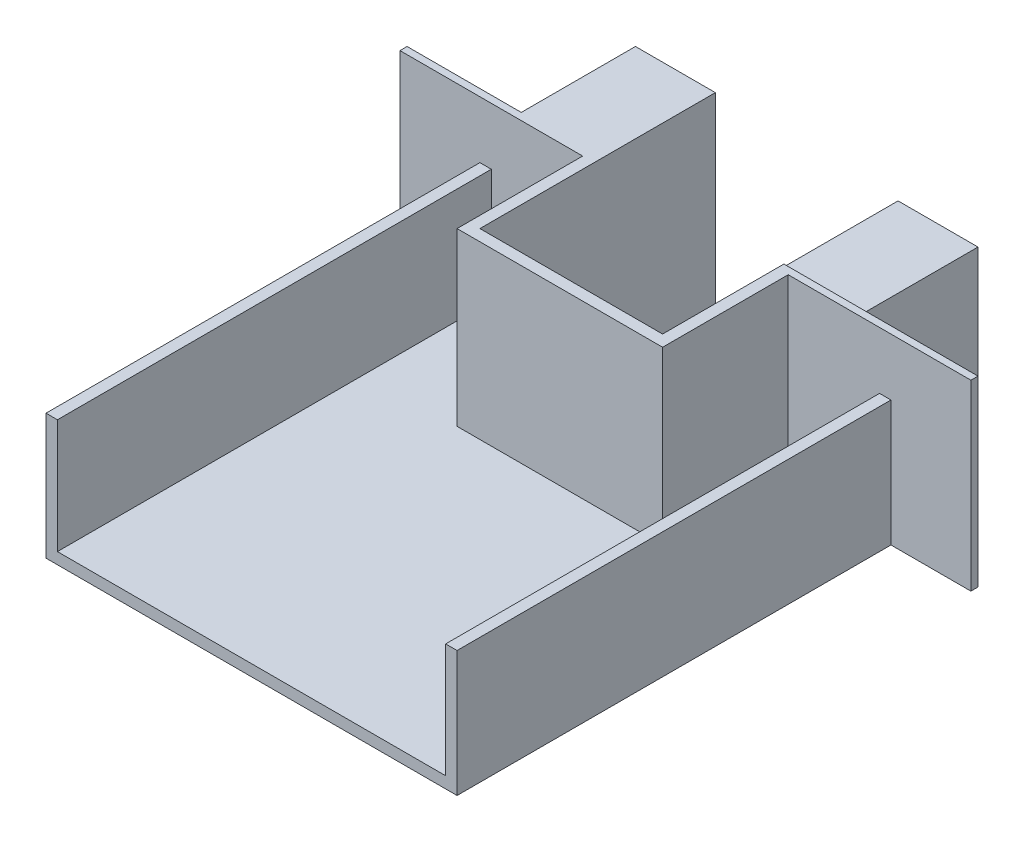
ISO-10303-21;
HEADER;
FILE_DESCRIPTION(('STEP AP214'),'2;1');
FILE_NAME('part.step','',(''),(''),'','','');
FILE_SCHEMA(('AUTOMOTIVE_DESIGN { 1 0 10303 214 1 1 1 1 }'));
ENDSEC;
DATA;
#1=APPLICATION_CONTEXT('core data for automotive mechanical design processes');
#2=APPLICATION_PROTOCOL_DEFINITION('international standard','automotive_design',2000,#1);
#3=PRODUCT_CONTEXT('',#1,'mechanical');
#4=PRODUCT('Part','Part','',(#3));
#5=PRODUCT_RELATED_PRODUCT_CATEGORY('part','',(#4));
#6=PRODUCT_DEFINITION_FORMATION('','',#4);
#7=PRODUCT_DEFINITION_CONTEXT('part definition',#1,'design');
#8=PRODUCT_DEFINITION('design','',#6,#7);
#9=PRODUCT_DEFINITION_SHAPE('','',#8);
#10=(LENGTH_UNIT() NAMED_UNIT(*) SI_UNIT(.MILLI.,.METRE.));
#11=(NAMED_UNIT(*) PLANE_ANGLE_UNIT() SI_UNIT($,.RADIAN.));
#12=(NAMED_UNIT(*) SI_UNIT($,.STERADIAN.) SOLID_ANGLE_UNIT());
#13=UNCERTAINTY_MEASURE_WITH_UNIT(LENGTH_MEASURE(1.E-05),#10,'distance_accuracy_value','');
#14=(GEOMETRIC_REPRESENTATION_CONTEXT(3) GLOBAL_UNCERTAINTY_ASSIGNED_CONTEXT((#13)) GLOBAL_UNIT_ASSIGNED_CONTEXT((#10,
#11,#12)) REPRESENTATION_CONTEXT('',''));
#15=CARTESIAN_POINT('',(0.,0.,0.));
#16=DIRECTION('',(0.,0.,1.));
#17=DIRECTION('',(1.,0.,0.));
#18=AXIS2_PLACEMENT_3D('',#15,#16,#17);
#19=CARTESIAN_POINT('',(-125.,80.,-95.));
#20=DIRECTION('',(0.,0.,-1.));
#21=DIRECTION('',(-1.,0.,0.));
#22=AXIS2_PLACEMENT_3D('',#19,#20,#21);
#23=PLANE('',#22);
#24=DIRECTION('',(0.,-1.,0.));
#25=VECTOR('',#24,1.);
#26=CARTESIAN_POINT('',(-45.,80.,-95.));
#27=LINE('',#26,#25);
#28=CARTESIAN_POINT('',(-45.,80.,-95.));
#29=VERTEX_POINT('',#28);
#30=CARTESIAN_POINT('',(-45.,5.,-95.));
#31=VERTEX_POINT('',#30);
#32=EDGE_CURVE('E204',#29,#31,#27,.T.);
#33=ORIENTED_EDGE('',*,*,#32,.F.);
#34=DIRECTION('',(1.,0.,0.));
#35=VECTOR('',#34,1.);
#36=CARTESIAN_POINT('',(-125.,80.,-95.));
#37=LINE('',#36,#35);
#38=CARTESIAN_POINT('',(-125.,80.,-95.));
#39=VERTEX_POINT('',#38);
#40=EDGE_CURVE('E216',#39,#29,#37,.T.);
#41=ORIENTED_EDGE('',*,*,#40,.F.);
#42=DIRECTION('',(0.,-1.,0.));
#43=VECTOR('',#42,1.);
#44=CARTESIAN_POINT('',(-125.,80.,-95.));
#45=LINE('',#44,#43);
#46=CARTESIAN_POINT('',(-125.,0.,-95.));
#47=VERTEX_POINT('',#46);
#48=EDGE_CURVE('E259',#39,#47,#45,.T.);
#49=ORIENTED_EDGE('',*,*,#48,.T.);
#50=DIRECTION('',(1.,0.,0.));
#51=VECTOR('',#50,1.);
#52=CARTESIAN_POINT('',(-125.,0.,-95.));
#53=LINE('',#52,#51);
#54=CARTESIAN_POINT('',(-90.,0.,-95.));
#55=VERTEX_POINT('',#54);
#56=EDGE_CURVE('E243',#47,#55,#53,.T.);
#57=ORIENTED_EDGE('',*,*,#56,.T.);
#58=DIRECTION('',(0.,-1.,0.));
#59=VECTOR('',#58,1.);
#60=CARTESIAN_POINT('',(-90.,5.,-95.));
#61=LINE('',#60,#59);
#62=CARTESIAN_POINT('',(-90.,55.,-95.));
#63=VERTEX_POINT('',#62);
#64=EDGE_CURVE('E314',#63,#55,#61,.T.);
#65=ORIENTED_EDGE('',*,*,#64,.F.);
#66=DIRECTION('',(-1.,0.,0.));
#67=VECTOR('',#66,1.);
#68=CARTESIAN_POINT('',(-90.,55.,-95.));
#69=LINE('',#68,#67);
#70=CARTESIAN_POINT('',(-85.,55.,-95.));
#71=VERTEX_POINT('',#70);
#72=EDGE_CURVE('E288',#71,#63,#69,.T.);
#73=ORIENTED_EDGE('',*,*,#72,.F.);
#74=DIRECTION('',(0.,-1.,0.));
#75=VECTOR('',#74,1.);
#76=CARTESIAN_POINT('',(-85.,55.,-95.));
#77=LINE('',#76,#75);
#78=CARTESIAN_POINT('',(-85.,5.,-95.));
#79=VERTEX_POINT('',#78);
#80=EDGE_CURVE('E290',#71,#79,#77,.T.);
#81=ORIENTED_EDGE('',*,*,#80,.T.);
#82=DIRECTION('',(-1.,0.,0.));
#83=VECTOR('',#82,1.);
#84=CARTESIAN_POINT('',(-90.,5.,-95.));
#85=LINE('',#84,#83);
#86=EDGE_CURVE('E219',#31,#79,#85,.T.);
#87=ORIENTED_EDGE('',*,*,#86,.F.);
#88=EDGE_LOOP('',(#33,#41,#49,#57,#65,#73,#81,#87));
#89=FACE_BOUND('',#88,.T.);
#90=ADVANCED_FACE('F33',(#89),#23,.F.);
#91=CARTESIAN_POINT('',(0.,5.,0.));
#92=DIRECTION('',(0.,1.,0.));
#93=DIRECTION('',(0.,0.,1.));
#94=AXIS2_PLACEMENT_3D('',#91,#92,#93);
#95=PLANE('',#94);
#96=DIRECTION('',(1.,0.,0.));
#97=VECTOR('',#96,1.);
#98=CARTESIAN_POINT('',(45.,5.,-40.));
#99=LINE('',#98,#97);
#100=CARTESIAN_POINT('',(-45.,5.,-40.));
#101=VERTEX_POINT('',#100);
#102=CARTESIAN_POINT('',(45.,5.,-40.));
#103=VERTEX_POINT('',#102);
#104=EDGE_CURVE('E460',#101,#103,#99,.T.);
#105=ORIENTED_EDGE('',*,*,#104,.F.);
#106=DIRECTION('',(0.,0.,1.));
#107=VECTOR('',#106,1.);
#108=CARTESIAN_POINT('',(-45.,5.,-40.));
#109=LINE('',#108,#107);
#110=EDGE_CURVE('E458',#31,#101,#109,.T.);
#111=ORIENTED_EDGE('',*,*,#110,.F.);
#112=ORIENTED_EDGE('',*,*,#86,.T.);
#113=DIRECTION('',(0.,0.,-1.));
#114=VECTOR('',#113,1.);
#115=CARTESIAN_POINT('',(-85.,5.,-95.));
#116=LINE('',#115,#114);
#117=CARTESIAN_POINT('',(-85.,5.,95.));
#118=VERTEX_POINT('',#117);
#119=EDGE_CURVE('E280',#118,#79,#116,.T.);
#120=ORIENTED_EDGE('',*,*,#119,.F.);
#121=DIRECTION('',(1.,0.,0.));
#122=VECTOR('',#121,1.);
#123=CARTESIAN_POINT('',(-90.,5.,95.));
#124=LINE('',#123,#122);
#125=CARTESIAN_POINT('',(84.9999999999999,5.,95.));
#126=VERTEX_POINT('',#125);
#127=EDGE_CURVE('E301',#118,#126,#124,.T.);
#128=ORIENTED_EDGE('',*,*,#127,.T.);
#129=DIRECTION('',(0.,0.,1.));
#130=VECTOR('',#129,1.);
#131=CARTESIAN_POINT('',(85.,5.,-95.));
#132=LINE('',#131,#130);
#133=CARTESIAN_POINT('',(84.9999999999999,5.,-95.));
#134=VERTEX_POINT('',#133);
#135=EDGE_CURVE('E261',#134,#126,#132,.T.);
#136=ORIENTED_EDGE('',*,*,#135,.F.);
#137=CARTESIAN_POINT('',(45.,5.,-95.));
#138=VERTEX_POINT('',#137);
#139=EDGE_CURVE('E298',#134,#138,#85,.T.);
#140=ORIENTED_EDGE('',*,*,#139,.T.);
#141=DIRECTION('',(0.,0.,-1.));
#142=VECTOR('',#141,1.);
#143=CARTESIAN_POINT('',(45.,5.,-95.));
#144=LINE('',#143,#142);
#145=EDGE_CURVE('E211',#103,#138,#144,.T.);
#146=ORIENTED_EDGE('',*,*,#145,.F.);
#147=EDGE_LOOP('',(#105,#111,#112,#120,#128,#136,#140,#146));
#148=FACE_BOUND('',#147,.T.);
#149=ADVANCED_FACE('F356',(#148),#95,.T.);
#150=DIRECTION('',(0.,-1.,0.));
#151=VECTOR('',#150,1.);
#152=CARTESIAN_POINT('',(45.,80.,-95.));
#153=LINE('',#152,#151);
#154=CARTESIAN_POINT('',(45.,80.,-95.));
#155=VERTEX_POINT('',#154);
#156=EDGE_CURVE('E348',#155,#138,#153,.T.);
#157=ORIENTED_EDGE('',*,*,#156,.T.);
#158=ORIENTED_EDGE('',*,*,#139,.F.);
#159=DIRECTION('',(0.,-1.,0.));
#160=VECTOR('',#159,1.);
#161=CARTESIAN_POINT('',(85.,55.,-95.));
#162=LINE('',#161,#160);
#163=CARTESIAN_POINT('',(85.,55.,-95.));
#164=VERTEX_POINT('',#163);
#165=EDGE_CURVE('E277',#164,#134,#162,.T.);
#166=ORIENTED_EDGE('',*,*,#165,.F.);
#167=DIRECTION('',(-1.,0.,0.));
#168=VECTOR('',#167,1.);
#169=CARTESIAN_POINT('',(90.,55.,-95.));
#170=LINE('',#169,#168);
#171=CARTESIAN_POINT('',(90.,55.,-95.));
#172=VERTEX_POINT('',#171);
#173=EDGE_CURVE('E265',#172,#164,#170,.T.);
#174=ORIENTED_EDGE('',*,*,#173,.F.);
#175=DIRECTION('',(0.,-1.,0.));
#176=VECTOR('',#175,1.);
#177=CARTESIAN_POINT('',(90.,5.,-95.));
#178=LINE('',#177,#176);
#179=CARTESIAN_POINT('',(90.,0.,-95.));
#180=VERTEX_POINT('',#179);
#181=EDGE_CURVE('E41',#172,#180,#178,.T.);
#182=ORIENTED_EDGE('',*,*,#181,.T.);
#183=CARTESIAN_POINT('',(125.,0.,-95.));
#184=VERTEX_POINT('',#183);
#185=EDGE_CURVE('E241',#180,#184,#53,.T.);
#186=ORIENTED_EDGE('',*,*,#185,.T.);
#187=DIRECTION('',(0.,-1.,0.));
#188=VECTOR('',#187,1.);
#189=CARTESIAN_POINT('',(125.,80.,-95.));
#190=LINE('',#189,#188);
#191=CARTESIAN_POINT('',(125.,80.,-95.));
#192=VERTEX_POINT('',#191);
#193=EDGE_CURVE('E256',#192,#184,#190,.T.);
#194=ORIENTED_EDGE('',*,*,#193,.F.);
#195=EDGE_CURVE('E228',#155,#192,#37,.T.);
#196=ORIENTED_EDGE('',*,*,#195,.F.);
#197=EDGE_LOOP('',(#157,#158,#166,#174,#182,#186,#194,#196));
#198=FACE_BOUND('',#197,.T.);
#199=ADVANCED_FACE('F320',(#198),#23,.F.);
#200=CARTESIAN_POINT('',(-125.,80.,-98.1090481998462));
#201=DIRECTION('',(0.,0.,1.));
#202=DIRECTION('',(1.,0.,0.));
#203=AXIS2_PLACEMENT_3D('',#200,#201,#202);
#204=PLANE('',#203);
#205=DIRECTION('',(1.,0.,0.));
#206=VECTOR('',#205,1.);
#207=CARTESIAN_POINT('',(75.,78.9484102153776,-98.1090481998462));
#208=LINE('',#207,#206);
#209=CARTESIAN_POINT('',(40.,78.9484102153776,-98.1090481998462));
#210=VERTEX_POINT('',#209);
#211=CARTESIAN_POINT('',(75.,78.9484102153776,-98.1090481998462));
#212=VERTEX_POINT('',#211);
#213=EDGE_CURVE('E406',#210,#212,#208,.T.);
#214=ORIENTED_EDGE('',*,*,#213,.F.);
#215=DIRECTION('',(0.,1.,0.));
#216=VECTOR('',#215,1.);
#217=CARTESIAN_POINT('',(40.,-43.,-98.1090481998462));
#218=LINE('',#217,#216);
#219=CARTESIAN_POINT('',(40.,80.,-98.1090481998462));
#220=VERTEX_POINT('',#219);
#221=EDGE_CURVE('E339',#210,#220,#218,.T.);
#222=ORIENTED_EDGE('',*,*,#221,.T.);
#223=DIRECTION('',(-1.,0.,0.));
#224=VECTOR('',#223,1.);
#225=CARTESIAN_POINT('',(-125.,80.,-98.1090481998462));
#226=LINE('',#225,#224);
#227=CARTESIAN_POINT('',(125.,80.,-98.1090481998462));
#228=VERTEX_POINT('',#227);
#229=EDGE_CURVE('E235',#228,#220,#226,.T.);
#230=ORIENTED_EDGE('',*,*,#229,.F.);
#231=DIRECTION('',(0.,-1.,0.));
#232=VECTOR('',#231,1.);
#233=CARTESIAN_POINT('',(125.,80.,-98.1090481998462));
#234=LINE('',#233,#232);
#235=CARTESIAN_POINT('',(125.,0.,-98.1090481998462));
#236=VERTEX_POINT('',#235);
#237=EDGE_CURVE('E253',#228,#236,#234,.T.);
#238=ORIENTED_EDGE('',*,*,#237,.T.);
#239=DIRECTION('',(-1.,0.,0.));
#240=VECTOR('',#239,1.);
#241=CARTESIAN_POINT('',(-125.,0.,-98.1090481998462));
#242=LINE('',#241,#240);
#243=CARTESIAN_POINT('',(75.,0.,-98.1090481998462));
#244=VERTEX_POINT('',#243);
#245=EDGE_CURVE('E249',#236,#244,#242,.T.);
#246=ORIENTED_EDGE('',*,*,#245,.T.);
#247=DIRECTION('',(0.,-1.,0.));
#248=VECTOR('',#247,1.);
#249=CARTESIAN_POINT('',(75.,78.9484102153776,-98.1090481998462));
#250=LINE('',#249,#248);
#251=EDGE_CURVE('E56',#212,#244,#250,.T.);
#252=ORIENTED_EDGE('',*,*,#251,.F.);
#253=EDGE_LOOP('',(#214,#222,#230,#238,#246,#252));
#254=FACE_BOUND('',#253,.T.);
#255=ADVANCED_FACE('F337',(#254),#204,.F.);
#256=DIRECTION('',(0.,1.,0.));
#257=VECTOR('',#256,1.);
#258=CARTESIAN_POINT('',(-75.,80.,-98.1090481998462));
#259=LINE('',#258,#257);
#260=CARTESIAN_POINT('',(-75.,0.,-98.1090481998462));
#261=VERTEX_POINT('',#260);
#262=CARTESIAN_POINT('',(-75.,80.,-98.1090481998462));
#263=VERTEX_POINT('',#262);
#264=EDGE_CURVE('E384',#261,#263,#259,.T.);
#265=ORIENTED_EDGE('',*,*,#264,.F.);
#266=CARTESIAN_POINT('',(-125.,0.,-98.1090481998462));
#267=VERTEX_POINT('',#266);
#268=EDGE_CURVE('E248',#261,#267,#242,.T.);
#269=ORIENTED_EDGE('',*,*,#268,.T.);
#270=DIRECTION('',(0.,-1.,0.));
#271=VECTOR('',#270,1.);
#272=CARTESIAN_POINT('',(-125.,80.,-98.1090481998462));
#273=LINE('',#272,#271);
#274=CARTESIAN_POINT('',(-125.,80.,-98.1090481998462));
#275=VERTEX_POINT('',#274);
#276=EDGE_CURVE('E237',#275,#267,#273,.T.);
#277=ORIENTED_EDGE('',*,*,#276,.F.);
#278=EDGE_CURVE('E230',#263,#275,#226,.T.);
#279=ORIENTED_EDGE('',*,*,#278,.F.);
#280=EDGE_LOOP('',(#265,#269,#277,#279));
#281=FACE_BOUND('',#280,.T.);
#282=ADVANCED_FACE('F382',(#281),#204,.F.);
#283=CARTESIAN_POINT('',(90.,5.,-95.));
#284=DIRECTION('',(-1.,0.,0.));
#285=DIRECTION('',(0.,0.,1.));
#286=AXIS2_PLACEMENT_3D('',#283,#284,#285);
#287=PLANE('',#286);
#288=DIRECTION('',(0.,0.,-1.));
#289=VECTOR('',#288,1.);
#290=CARTESIAN_POINT('',(90.,0.,-95.));
#291=LINE('',#290,#289);
#292=CARTESIAN_POINT('',(90.,0.,95.));
#293=VERTEX_POINT('',#292);
#294=EDGE_CURVE('E297',#293,#180,#291,.T.);
#295=ORIENTED_EDGE('',*,*,#294,.T.);
#296=ORIENTED_EDGE('',*,*,#181,.F.);
#297=DIRECTION('',(0.,0.,-1.));
#298=VECTOR('',#297,1.);
#299=CARTESIAN_POINT('',(90.,55.,-95.));
#300=LINE('',#299,#298);
#301=CARTESIAN_POINT('',(90.,55.,95.));
#302=VERTEX_POINT('',#301);
#303=EDGE_CURVE('E262',#302,#172,#300,.T.);
#304=ORIENTED_EDGE('',*,*,#303,.F.);
#305=DIRECTION('',(0.,-1.,0.));
#306=VECTOR('',#305,1.);
#307=CARTESIAN_POINT('',(90.,5.,95.));
#308=LINE('',#307,#306);
#309=EDGE_CURVE('E303',#302,#293,#308,.T.);
#310=ORIENTED_EDGE('',*,*,#309,.T.);
#311=EDGE_LOOP('',(#295,#296,#304,#310));
#312=FACE_BOUND('',#311,.T.);
#313=ADVANCED_FACE('F35',(#312),#287,.F.);
#314=CARTESIAN_POINT('',(-90.,5.,-95.));
#315=DIRECTION('',(1.,0.,0.));
#316=DIRECTION('',(0.,0.,-1.));
#317=AXIS2_PLACEMENT_3D('',#314,#315,#316);
#318=PLANE('',#317);
#319=DIRECTION('',(0.,0.,1.));
#320=VECTOR('',#319,1.);
#321=CARTESIAN_POINT('',(-90.,0.,-95.));
#322=LINE('',#321,#320);
#323=CARTESIAN_POINT('',(-90.,0.,95.));
#324=VERTEX_POINT('',#323);
#325=EDGE_CURVE('E305',#55,#324,#322,.T.);
#326=ORIENTED_EDGE('',*,*,#325,.T.);
#327=DIRECTION('',(0.,-1.,0.));
#328=VECTOR('',#327,1.);
#329=CARTESIAN_POINT('',(-90.,5.,95.));
#330=LINE('',#329,#328);
#331=CARTESIAN_POINT('',(-90.,55.,95.));
#332=VERTEX_POINT('',#331);
#333=EDGE_CURVE('E311',#332,#324,#330,.T.);
#334=ORIENTED_EDGE('',*,*,#333,.F.);
#335=DIRECTION('',(0.,0.,1.));
#336=VECTOR('',#335,1.);
#337=CARTESIAN_POINT('',(-90.,55.,-95.));
#338=LINE('',#337,#336);
#339=EDGE_CURVE('E281',#63,#332,#338,.T.);
#340=ORIENTED_EDGE('',*,*,#339,.F.);
#341=ORIENTED_EDGE('',*,*,#64,.T.);
#342=EDGE_LOOP('',(#326,#334,#340,#341));
#343=FACE_BOUND('',#342,.T.);
#344=ADVANCED_FACE('F476',(#343),#318,.F.);
#345=CARTESIAN_POINT('',(-90.,5.,95.));
#346=DIRECTION('',(0.,0.,-1.));
#347=DIRECTION('',(-1.,0.,0.));
#348=AXIS2_PLACEMENT_3D('',#345,#346,#347);
#349=PLANE('',#348);
#350=DIRECTION('',(1.,0.,0.));
#351=VECTOR('',#350,1.);
#352=CARTESIAN_POINT('',(-90.,0.,95.));
#353=LINE('',#352,#351);
#354=EDGE_CURVE('E307',#324,#293,#353,.T.);
#355=ORIENTED_EDGE('',*,*,#354,.T.);
#356=ORIENTED_EDGE('',*,*,#309,.F.);
#357=DIRECTION('',(1.,0.,0.));
#358=VECTOR('',#357,1.);
#359=CARTESIAN_POINT('',(90.,55.,95.));
#360=LINE('',#359,#358);
#361=CARTESIAN_POINT('',(85.,55.,95.));
#362=VERTEX_POINT('',#361);
#363=EDGE_CURVE('E269',#362,#302,#360,.T.);
#364=ORIENTED_EDGE('',*,*,#363,.F.);
#365=DIRECTION('',(0.,-1.,0.));
#366=VECTOR('',#365,1.);
#367=CARTESIAN_POINT('',(85.,55.,95.));
#368=LINE('',#367,#366);
#369=EDGE_CURVE('E272',#362,#126,#368,.T.);
#370=ORIENTED_EDGE('',*,*,#369,.T.);
#371=ORIENTED_EDGE('',*,*,#127,.F.);
#372=DIRECTION('',(0.,-1.,0.));
#373=VECTOR('',#372,1.);
#374=CARTESIAN_POINT('',(-85.,55.,95.));
#375=LINE('',#374,#373);
#376=CARTESIAN_POINT('',(-85.,55.,95.));
#377=VERTEX_POINT('',#376);
#378=EDGE_CURVE('E294',#377,#118,#375,.T.);
#379=ORIENTED_EDGE('',*,*,#378,.F.);
#380=DIRECTION('',(1.,0.,0.));
#381=VECTOR('',#380,1.);
#382=CARTESIAN_POINT('',(-90.,55.,95.));
#383=LINE('',#382,#381);
#384=EDGE_CURVE('E284',#332,#377,#383,.T.);
#385=ORIENTED_EDGE('',*,*,#384,.F.);
#386=ORIENTED_EDGE('',*,*,#333,.T.);
#387=EDGE_LOOP('',(#355,#356,#364,#370,#371,#379,#385,#386));
#388=FACE_BOUND('',#387,.T.);
#389=ADVANCED_FACE('F366',(#388),#349,.F.);
#390=CARTESIAN_POINT('',(0.,0.,0.));
#391=DIRECTION('',(0.,1.,0.));
#392=DIRECTION('',(0.,0.,1.));
#393=AXIS2_PLACEMENT_3D('',#390,#391,#392);
#394=PLANE('',#393);
#395=DIRECTION('',(0.,0.,1.));
#396=VECTOR('',#395,1.);
#397=CARTESIAN_POINT('',(-40.,0.,-148.109048199846));
#398=LINE('',#397,#396);
#399=CARTESIAN_POINT('',(-40.,0.,-148.109048199846));
#400=VERTEX_POINT('',#399);
#401=CARTESIAN_POINT('',(-40.,0.,-45.));
#402=VERTEX_POINT('',#401);
#403=EDGE_CURVE('E400',#400,#402,#398,.T.);
#404=ORIENTED_EDGE('',*,*,#403,.T.);
#405=DIRECTION('',(1.,0.,0.));
#406=VECTOR('',#405,1.);
#407=CARTESIAN_POINT('',(0.,0.,-45.));
#408=LINE('',#407,#406);
#409=CARTESIAN_POINT('',(40.,0.,-45.));
#410=VERTEX_POINT('',#409);
#411=EDGE_CURVE('E11',#402,#410,#408,.T.);
#412=ORIENTED_EDGE('',*,*,#411,.T.);
#413=DIRECTION('',(0.,0.,1.));
#414=VECTOR('',#413,1.);
#415=CARTESIAN_POINT('',(40.,0.,-148.109048199846));
#416=LINE('',#415,#414);
#417=CARTESIAN_POINT('',(40.,0.,-148.109048199846));
#418=VERTEX_POINT('',#417);
#419=EDGE_CURVE('E420',#418,#410,#416,.T.);
#420=ORIENTED_EDGE('',*,*,#419,.F.);
#421=DIRECTION('',(-1.,0.,0.));
#422=VECTOR('',#421,1.);
#423=CARTESIAN_POINT('',(75.,0.,-148.109048199846));
#424=LINE('',#423,#422);
#425=CARTESIAN_POINT('',(75.,0.,-148.109048199846));
#426=VERTEX_POINT('',#425);
#427=EDGE_CURVE('E405',#426,#418,#424,.T.);
#428=ORIENTED_EDGE('',*,*,#427,.F.);
#429=DIRECTION('',(0.,0.,1.));
#430=VECTOR('',#429,1.);
#431=CARTESIAN_POINT('',(75.,0.,-148.109048199846));
#432=LINE('',#431,#430);
#433=EDGE_CURVE('E242',#426,#244,#432,.T.);
#434=ORIENTED_EDGE('',*,*,#433,.T.);
#435=ORIENTED_EDGE('',*,*,#245,.F.);
#436=DIRECTION('',(0.,0.,-1.));
#437=VECTOR('',#436,1.);
#438=CARTESIAN_POINT('',(125.,0.,-95.));
#439=LINE('',#438,#437);
#440=EDGE_CURVE('E246',#184,#236,#439,.T.);
#441=ORIENTED_EDGE('',*,*,#440,.F.);
#442=ORIENTED_EDGE('',*,*,#185,.F.);
#443=ORIENTED_EDGE('',*,*,#294,.F.);
#444=ORIENTED_EDGE('',*,*,#354,.F.);
#445=ORIENTED_EDGE('',*,*,#325,.F.);
#446=ORIENTED_EDGE('',*,*,#56,.F.);
#447=DIRECTION('',(0.,0.,1.));
#448=VECTOR('',#447,1.);
#449=CARTESIAN_POINT('',(-125.,0.,-95.));
#450=LINE('',#449,#448);
#451=EDGE_CURVE('E238',#267,#47,#450,.T.);
#452=ORIENTED_EDGE('',*,*,#451,.F.);
#453=ORIENTED_EDGE('',*,*,#268,.F.);
#454=DIRECTION('',(0.,0.,1.));
#455=VECTOR('',#454,1.);
#456=CARTESIAN_POINT('',(-75.,0.,-148.109048199846));
#457=LINE('',#456,#455);
#458=CARTESIAN_POINT('',(-75.,0.,-148.109048199846));
#459=VERTEX_POINT('',#458);
#460=EDGE_CURVE('E378',#459,#261,#457,.T.);
#461=ORIENTED_EDGE('',*,*,#460,.F.);
#462=DIRECTION('',(-1.,0.,0.));
#463=VECTOR('',#462,1.);
#464=CARTESIAN_POINT('',(-40.,0.,-148.109048199846));
#465=LINE('',#464,#463);
#466=EDGE_CURVE('E389',#400,#459,#465,.T.);
#467=ORIENTED_EDGE('',*,*,#466,.F.);
#468=EDGE_LOOP('',(#404,#412,#420,#428,#434,#435,#441,#442,#443,#444,#445,#446,#452,#453,#461,#467));
#469=FACE_BOUND('',#468,.T.);
#470=ADVANCED_FACE('F328',(#469),#394,.F.);
#471=CARTESIAN_POINT('',(-85.,55.,-95.));
#472=DIRECTION('',(-1.,0.,0.));
#473=DIRECTION('',(0.,0.,1.));
#474=AXIS2_PLACEMENT_3D('',#471,#472,#473);
#475=PLANE('',#474);
#476=ORIENTED_EDGE('',*,*,#119,.T.);
#477=ORIENTED_EDGE('',*,*,#80,.F.);
#478=DIRECTION('',(0.,0.,-1.));
#479=VECTOR('',#478,1.);
#480=CARTESIAN_POINT('',(-85.,55.,-95.));
#481=LINE('',#480,#479);
#482=EDGE_CURVE('E286',#377,#71,#481,.T.);
#483=ORIENTED_EDGE('',*,*,#482,.F.);
#484=ORIENTED_EDGE('',*,*,#378,.T.);
#485=EDGE_LOOP('',(#476,#477,#483,#484));
#486=FACE_BOUND('',#485,.T.);
#487=ADVANCED_FACE('F470',(#486),#475,.F.);
#488=CARTESIAN_POINT('',(0.,55.,0.));
#489=DIRECTION('',(0.,1.,0.));
#490=DIRECTION('',(0.,0.,1.));
#491=AXIS2_PLACEMENT_3D('',#488,#489,#490);
#492=PLANE('',#491);
#493=ORIENTED_EDGE('',*,*,#339,.T.);
#494=ORIENTED_EDGE('',*,*,#384,.T.);
#495=ORIENTED_EDGE('',*,*,#482,.T.);
#496=ORIENTED_EDGE('',*,*,#72,.T.);
#497=EDGE_LOOP('',(#493,#494,#495,#496));
#498=FACE_BOUND('',#497,.T.);
#499=ADVANCED_FACE('F475',(#498),#492,.T.);
#500=CARTESIAN_POINT('',(85.,55.,-95.));
#501=DIRECTION('',(1.,0.,0.));
#502=DIRECTION('',(0.,0.,-1.));
#503=AXIS2_PLACEMENT_3D('',#500,#501,#502);
#504=PLANE('',#503);
#505=ORIENTED_EDGE('',*,*,#135,.T.);
#506=ORIENTED_EDGE('',*,*,#369,.F.);
#507=DIRECTION('',(0.,0.,1.));
#508=VECTOR('',#507,1.);
#509=CARTESIAN_POINT('',(85.,55.,-95.));
#510=LINE('',#509,#508);
#511=EDGE_CURVE('E267',#164,#362,#510,.T.);
#512=ORIENTED_EDGE('',*,*,#511,.F.);
#513=ORIENTED_EDGE('',*,*,#165,.T.);
#514=EDGE_LOOP('',(#505,#506,#512,#513));
#515=FACE_BOUND('',#514,.T.);
#516=ADVANCED_FACE('F361',(#515),#504,.F.);
#517=CARTESIAN_POINT('',(0.,55.,0.));
#518=DIRECTION('',(0.,-1.,0.));
#519=DIRECTION('',(0.,0.,-1.));
#520=AXIS2_PLACEMENT_3D('',#517,#518,#519);
#521=PLANE('',#520);
#522=ORIENTED_EDGE('',*,*,#303,.T.);
#523=ORIENTED_EDGE('',*,*,#173,.T.);
#524=ORIENTED_EDGE('',*,*,#511,.T.);
#525=ORIENTED_EDGE('',*,*,#363,.T.);
#526=EDGE_LOOP('',(#522,#523,#524,#525));
#527=FACE_BOUND('',#526,.T.);
#528=ADVANCED_FACE('F364',(#527),#521,.F.);
#529=CARTESIAN_POINT('',(-125.,80.,-95.));
#530=DIRECTION('',(1.,0.,0.));
#531=DIRECTION('',(0.,0.,-1.));
#532=AXIS2_PLACEMENT_3D('',#529,#530,#531);
#533=PLANE('',#532);
#534=ORIENTED_EDGE('',*,*,#451,.T.);
#535=ORIENTED_EDGE('',*,*,#48,.F.);
#536=DIRECTION('',(0.,0.,1.));
#537=VECTOR('',#536,1.);
#538=CARTESIAN_POINT('',(-125.,80.,-95.));
#539=LINE('',#538,#537);
#540=EDGE_CURVE('E225',#275,#39,#539,.T.);
#541=ORIENTED_EDGE('',*,*,#540,.F.);
#542=ORIENTED_EDGE('',*,*,#276,.T.);
#543=EDGE_LOOP('',(#534,#535,#541,#542));
#544=FACE_BOUND('',#543,.T.);
#545=ADVANCED_FACE('F374',(#544),#533,.F.);
#546=CARTESIAN_POINT('',(125.,80.,-95.));
#547=DIRECTION('',(-1.,0.,0.));
#548=DIRECTION('',(0.,0.,1.));
#549=AXIS2_PLACEMENT_3D('',#546,#547,#548);
#550=PLANE('',#549);
#551=ORIENTED_EDGE('',*,*,#440,.T.);
#552=ORIENTED_EDGE('',*,*,#237,.F.);
#553=DIRECTION('',(0.,0.,-1.));
#554=VECTOR('',#553,1.);
#555=CARTESIAN_POINT('',(125.,80.,-95.));
#556=LINE('',#555,#554);
#557=EDGE_CURVE('E227',#192,#228,#556,.T.);
#558=ORIENTED_EDGE('',*,*,#557,.F.);
#559=ORIENTED_EDGE('',*,*,#193,.T.);
#560=EDGE_LOOP('',(#551,#552,#558,#559));
#561=FACE_BOUND('',#560,.T.);
#562=ADVANCED_FACE('F334',(#561),#550,.F.);
#563=CARTESIAN_POINT('',(0.,80.,0.));
#564=DIRECTION('',(0.,-1.,0.));
#565=DIRECTION('',(0.,0.,-1.));
#566=AXIS2_PLACEMENT_3D('',#563,#564,#565);
#567=PLANE('',#566);
#568=ORIENTED_EDGE('',*,*,#229,.T.);
#569=DIRECTION('',(0.,0.,-1.));
#570=VECTOR('',#569,1.);
#571=CARTESIAN_POINT('',(40.,80.,-98.1090481998462));
#572=LINE('',#571,#570);
#573=CARTESIAN_POINT('',(40.,80.,-45.));
#574=VERTEX_POINT('',#573);
#575=EDGE_CURVE('E341',#574,#220,#572,.T.);
#576=ORIENTED_EDGE('',*,*,#575,.F.);
#577=DIRECTION('',(-1.,0.,0.));
#578=VECTOR('',#577,1.);
#579=CARTESIAN_POINT('',(-40.,80.,-45.));
#580=LINE('',#579,#578);
#581=CARTESIAN_POINT('',(-40.,80.,-45.));
#582=VERTEX_POINT('',#581);
#583=EDGE_CURVE('E351',#574,#582,#580,.T.);
#584=ORIENTED_EDGE('',*,*,#583,.T.);
#585=DIRECTION('',(0.,0.,1.));
#586=VECTOR('',#585,1.);
#587=CARTESIAN_POINT('',(-40.,80.,-148.109048199846));
#588=LINE('',#587,#586);
#589=CARTESIAN_POINT('',(-40.,80.,-148.109048199846));
#590=VERTEX_POINT('',#589);
#591=EDGE_CURVE('E396',#590,#582,#588,.T.);
#592=ORIENTED_EDGE('',*,*,#591,.F.);
#593=DIRECTION('',(1.,0.,0.));
#594=VECTOR('',#593,1.);
#595=CARTESIAN_POINT('',(-40.,80.,-148.109048199846));
#596=LINE('',#595,#594);
#597=CARTESIAN_POINT('',(-75.,80.,-148.109048199846));
#598=VERTEX_POINT('',#597);
#599=EDGE_CURVE('E394',#598,#590,#596,.T.);
#600=ORIENTED_EDGE('',*,*,#599,.F.);
#601=DIRECTION('',(0.,0.,1.));
#602=VECTOR('',#601,1.);
#603=CARTESIAN_POINT('',(-75.,80.,-148.109048199846));
#604=LINE('',#603,#602);
#605=EDGE_CURVE('E48',#598,#263,#604,.T.);
#606=ORIENTED_EDGE('',*,*,#605,.T.);
#607=ORIENTED_EDGE('',*,*,#278,.T.);
#608=ORIENTED_EDGE('',*,*,#540,.T.);
#609=ORIENTED_EDGE('',*,*,#40,.T.);
#610=DIRECTION('',(0.,0.,1.));
#611=VECTOR('',#610,1.);
#612=CARTESIAN_POINT('',(-45.,80.,-40.));
#613=LINE('',#612,#611);
#614=CARTESIAN_POINT('',(-45.,80.,-40.));
#615=VERTEX_POINT('',#614);
#616=EDGE_CURVE('E201',#29,#615,#613,.T.);
#617=ORIENTED_EDGE('',*,*,#616,.T.);
#618=DIRECTION('',(1.,0.,0.));
#619=VECTOR('',#618,1.);
#620=CARTESIAN_POINT('',(45.,80.,-40.));
#621=LINE('',#620,#619);
#622=CARTESIAN_POINT('',(45.,80.,-40.));
#623=VERTEX_POINT('',#622);
#624=EDGE_CURVE('E210',#615,#623,#621,.T.);
#625=ORIENTED_EDGE('',*,*,#624,.T.);
#626=DIRECTION('',(0.,0.,-1.));
#627=VECTOR('',#626,1.);
#628=CARTESIAN_POINT('',(45.,80.,-95.));
#629=LINE('',#628,#627);
#630=EDGE_CURVE('E345',#623,#155,#629,.T.);
#631=ORIENTED_EDGE('',*,*,#630,.T.);
#632=ORIENTED_EDGE('',*,*,#195,.T.);
#633=ORIENTED_EDGE('',*,*,#557,.T.);
#634=EDGE_LOOP('',(#568,#576,#584,#592,#600,#606,#607,#608,#609,#617,#625,#631,#632,#633));
#635=FACE_BOUND('',#634,.T.);
#636=ADVANCED_FACE('F223',(#635),#567,.F.);
#637=CARTESIAN_POINT('',(75.,78.9484102153776,-148.109048199846));
#638=DIRECTION('',(-1.,0.,0.));
#639=DIRECTION('',(0.,-1.,0.));
#640=AXIS2_PLACEMENT_3D('',#637,#638,#639);
#641=PLANE('',#640);
#642=ORIENTED_EDGE('',*,*,#251,.T.);
#643=ORIENTED_EDGE('',*,*,#433,.F.);
#644=DIRECTION('',(0.,-1.,0.));
#645=VECTOR('',#644,1.);
#646=CARTESIAN_POINT('',(75.,78.9484102153776,-148.109048199846));
#647=LINE('',#646,#645);
#648=CARTESIAN_POINT('',(75.,78.9484102153776,-148.109048199846));
#649=VERTEX_POINT('',#648);
#650=EDGE_CURVE('E402',#649,#426,#647,.T.);
#651=ORIENTED_EDGE('',*,*,#650,.F.);
#652=DIRECTION('',(0.,0.,1.));
#653=VECTOR('',#652,1.);
#654=CARTESIAN_POINT('',(75.,78.9484102153776,-148.109048199846));
#655=LINE('',#654,#653);
#656=EDGE_CURVE('E412',#649,#212,#655,.T.);
#657=ORIENTED_EDGE('',*,*,#656,.T.);
#658=EDGE_LOOP('',(#642,#643,#651,#657));
#659=FACE_BOUND('',#658,.T.);
#660=ADVANCED_FACE('F425',(#659),#641,.F.);
#661=CARTESIAN_POINT('',(40.,78.9484102153776,-148.109048199846));
#662=DIRECTION('',(1.,0.,0.));
#663=DIRECTION('',(0.,1.,0.));
#664=AXIS2_PLACEMENT_3D('',#661,#662,#663);
#665=PLANE('',#664);
#666=DIRECTION('',(0.,1.,0.));
#667=VECTOR('',#666,1.);
#668=CARTESIAN_POINT('',(40.,-118.,-45.));
#669=LINE('',#668,#667);
#670=EDGE_CURVE('E435',#410,#574,#669,.T.);
#671=ORIENTED_EDGE('',*,*,#670,.T.);
#672=ORIENTED_EDGE('',*,*,#575,.T.);
#673=ORIENTED_EDGE('',*,*,#221,.F.);
#674=DIRECTION('',(0.,0.,1.));
#675=VECTOR('',#674,1.);
#676=CARTESIAN_POINT('',(40.,78.9484102153776,-148.109048199846));
#677=LINE('',#676,#675);
#678=CARTESIAN_POINT('',(40.,78.9484102153776,-148.109048199846));
#679=VERTEX_POINT('',#678);
#680=EDGE_CURVE('E417',#679,#210,#677,.T.);
#681=ORIENTED_EDGE('',*,*,#680,.F.);
#682=DIRECTION('',(0.,1.,0.));
#683=VECTOR('',#682,1.);
#684=CARTESIAN_POINT('',(40.,78.9484102153776,-148.109048199846));
#685=LINE('',#684,#683);
#686=EDGE_CURVE('E408',#418,#679,#685,.T.);
#687=ORIENTED_EDGE('',*,*,#686,.F.);
#688=ORIENTED_EDGE('',*,*,#419,.T.);
#689=EDGE_LOOP('',(#671,#672,#673,#681,#687,#688));
#690=FACE_BOUND('',#689,.T.);
#691=ADVANCED_FACE('F433',(#690),#665,.F.);
#692=CARTESIAN_POINT('',(75.,78.9484102153776,-148.109048199846));
#693=DIRECTION('',(0.,-1.,0.));
#694=DIRECTION('',(0.,0.,-1.));
#695=AXIS2_PLACEMENT_3D('',#692,#693,#694);
#696=PLANE('',#695);
#697=ORIENTED_EDGE('',*,*,#213,.T.);
#698=ORIENTED_EDGE('',*,*,#656,.F.);
#699=DIRECTION('',(1.,0.,0.));
#700=VECTOR('',#699,1.);
#701=CARTESIAN_POINT('',(75.,78.9484102153776,-148.109048199846));
#702=LINE('',#701,#700);
#703=EDGE_CURVE('E410',#679,#649,#702,.T.);
#704=ORIENTED_EDGE('',*,*,#703,.F.);
#705=ORIENTED_EDGE('',*,*,#680,.T.);
#706=EDGE_LOOP('',(#697,#698,#704,#705));
#707=FACE_BOUND('',#706,.T.);
#708=ADVANCED_FACE('F429',(#707),#696,.F.);
#709=CARTESIAN_POINT('',(0.,0.,-148.109048199846));
#710=DIRECTION('',(0.,0.,-1.));
#711=DIRECTION('',(-1.,0.,0.));
#712=AXIS2_PLACEMENT_3D('',#709,#710,#711);
#713=PLANE('',#712);
#714=ORIENTED_EDGE('',*,*,#650,.T.);
#715=ORIENTED_EDGE('',*,*,#427,.T.);
#716=ORIENTED_EDGE('',*,*,#686,.T.);
#717=ORIENTED_EDGE('',*,*,#703,.T.);
#718=EDGE_LOOP('',(#714,#715,#716,#717));
#719=FACE_BOUND('',#718,.T.);
#720=ADVANCED_FACE('F571',(#719),#713,.T.);
#721=CARTESIAN_POINT('',(-40.,80.,-148.109048199846));
#722=DIRECTION('',(-1.,0.,0.));
#723=DIRECTION('',(0.,-1.,0.));
#724=AXIS2_PLACEMENT_3D('',#721,#722,#723);
#725=PLANE('',#724);
#726=ORIENTED_EDGE('',*,*,#591,.T.);
#727=DIRECTION('',(0.,1.,0.));
#728=VECTOR('',#727,1.);
#729=CARTESIAN_POINT('',(-40.,-118.,-45.));
#730=LINE('',#729,#728);
#731=EDGE_CURVE('E220',#402,#582,#730,.T.);
#732=ORIENTED_EDGE('',*,*,#731,.F.);
#733=ORIENTED_EDGE('',*,*,#403,.F.);
#734=DIRECTION('',(0.,-1.,0.));
#735=VECTOR('',#734,1.);
#736=CARTESIAN_POINT('',(-40.,80.,-148.109048199846));
#737=LINE('',#736,#735);
#738=EDGE_CURVE('E386',#590,#400,#737,.T.);
#739=ORIENTED_EDGE('',*,*,#738,.F.);
#740=EDGE_LOOP('',(#726,#732,#733,#739));
#741=FACE_BOUND('',#740,.T.);
#742=ADVANCED_FACE('F450',(#741),#725,.F.);
#743=CARTESIAN_POINT('',(-75.,80.,-148.109048199846));
#744=DIRECTION('',(1.,0.,0.));
#745=DIRECTION('',(0.,1.,0.));
#746=AXIS2_PLACEMENT_3D('',#743,#744,#745);
#747=PLANE('',#746);
#748=ORIENTED_EDGE('',*,*,#264,.T.);
#749=ORIENTED_EDGE('',*,*,#605,.F.);
#750=DIRECTION('',(0.,1.,0.));
#751=VECTOR('',#750,1.);
#752=CARTESIAN_POINT('',(-75.,80.,-148.109048199846));
#753=LINE('',#752,#751);
#754=EDGE_CURVE('E441',#459,#598,#753,.T.);
#755=ORIENTED_EDGE('',*,*,#754,.F.);
#756=ORIENTED_EDGE('',*,*,#460,.T.);
#757=EDGE_LOOP('',(#748,#749,#755,#756));
#758=FACE_BOUND('',#757,.T.);
#759=ADVANCED_FACE('F585',(#758),#747,.F.);
#760=CARTESIAN_POINT('',(0.,0.,-148.109048199846));
#761=DIRECTION('',(0.,0.,-1.));
#762=DIRECTION('',(-1.,0.,0.));
#763=AXIS2_PLACEMENT_3D('',#760,#761,#762);
#764=PLANE('',#763);
#765=ORIENTED_EDGE('',*,*,#738,.T.);
#766=ORIENTED_EDGE('',*,*,#466,.T.);
#767=ORIENTED_EDGE('',*,*,#754,.T.);
#768=ORIENTED_EDGE('',*,*,#599,.T.);
#769=EDGE_LOOP('',(#765,#766,#767,#768));
#770=FACE_BOUND('',#769,.T.);
#771=ADVANCED_FACE('F444',(#770),#764,.T.);
#772=CARTESIAN_POINT('',(-40.,-118.,-45.));
#773=DIRECTION('',(0.,0.,1.));
#774=DIRECTION('',(1.,0.,0.));
#775=AXIS2_PLACEMENT_3D('',#772,#773,#774);
#776=PLANE('',#775);
#777=ORIENTED_EDGE('',*,*,#731,.T.);
#778=ORIENTED_EDGE('',*,*,#583,.F.);
#779=ORIENTED_EDGE('',*,*,#670,.F.);
#780=ORIENTED_EDGE('',*,*,#411,.F.);
#781=EDGE_LOOP('',(#777,#778,#779,#780));
#782=FACE_BOUND('',#781,.T.);
#783=ADVANCED_FACE('F453',(#782),#776,.F.);
#784=CARTESIAN_POINT('',(-45.,80.,-40.));
#785=DIRECTION('',(1.,0.,0.));
#786=DIRECTION('',(0.,0.,-1.));
#787=AXIS2_PLACEMENT_3D('',#784,#785,#786);
#788=PLANE('',#787);
#789=ORIENTED_EDGE('',*,*,#110,.T.);
#790=DIRECTION('',(0.,-1.,0.));
#791=VECTOR('',#790,1.);
#792=CARTESIAN_POINT('',(-45.,80.,-40.));
#793=LINE('',#792,#791);
#794=EDGE_CURVE('E207',#615,#101,#793,.T.);
#795=ORIENTED_EDGE('',*,*,#794,.F.);
#796=ORIENTED_EDGE('',*,*,#616,.F.);
#797=ORIENTED_EDGE('',*,*,#32,.T.);
#798=EDGE_LOOP('',(#789,#795,#796,#797));
#799=FACE_BOUND('',#798,.T.);
#800=ADVANCED_FACE('F203',(#799),#788,.F.);
#801=CARTESIAN_POINT('',(45.,80.,-40.));
#802=DIRECTION('',(0.,0.,-1.));
#803=DIRECTION('',(-1.,0.,0.));
#804=AXIS2_PLACEMENT_3D('',#801,#802,#803);
#805=PLANE('',#804);
#806=ORIENTED_EDGE('',*,*,#104,.T.);
#807=DIRECTION('',(0.,-1.,0.));
#808=VECTOR('',#807,1.);
#809=CARTESIAN_POINT('',(45.,80.,-40.));
#810=LINE('',#809,#808);
#811=EDGE_CURVE('E350',#623,#103,#810,.T.);
#812=ORIENTED_EDGE('',*,*,#811,.F.);
#813=ORIENTED_EDGE('',*,*,#624,.F.);
#814=ORIENTED_EDGE('',*,*,#794,.T.);
#815=EDGE_LOOP('',(#806,#812,#813,#814));
#816=FACE_BOUND('',#815,.T.);
#817=ADVANCED_FACE('F466',(#816),#805,.F.);
#818=CARTESIAN_POINT('',(45.,80.,-95.));
#819=DIRECTION('',(-1.,0.,0.));
#820=DIRECTION('',(0.,0.,1.));
#821=AXIS2_PLACEMENT_3D('',#818,#819,#820);
#822=PLANE('',#821);
#823=ORIENTED_EDGE('',*,*,#145,.T.);
#824=ORIENTED_EDGE('',*,*,#156,.F.);
#825=ORIENTED_EDGE('',*,*,#630,.F.);
#826=ORIENTED_EDGE('',*,*,#811,.T.);
#827=EDGE_LOOP('',(#823,#824,#825,#826));
#828=FACE_BOUND('',#827,.T.);
#829=ADVANCED_FACE('F652',(#828),#822,.F.);
#830=CLOSED_SHELL('',(#90,#149,#199,#255,#282,#313,#344,#389,#470,#487,#499,#516,#528,#545,#562,
#636,#660,#691,#708,#720,#742,#759,#771,#783,#800,#817,#829));
#831=MANIFOLD_SOLID_BREP('B2',#830);
#832=ADVANCED_BREP_SHAPE_REPRESENTATION('',(#18,#831),#14);
#833=SHAPE_DEFINITION_REPRESENTATION(#9,#832);
ENDSEC;
END-ISO-10303-21;
